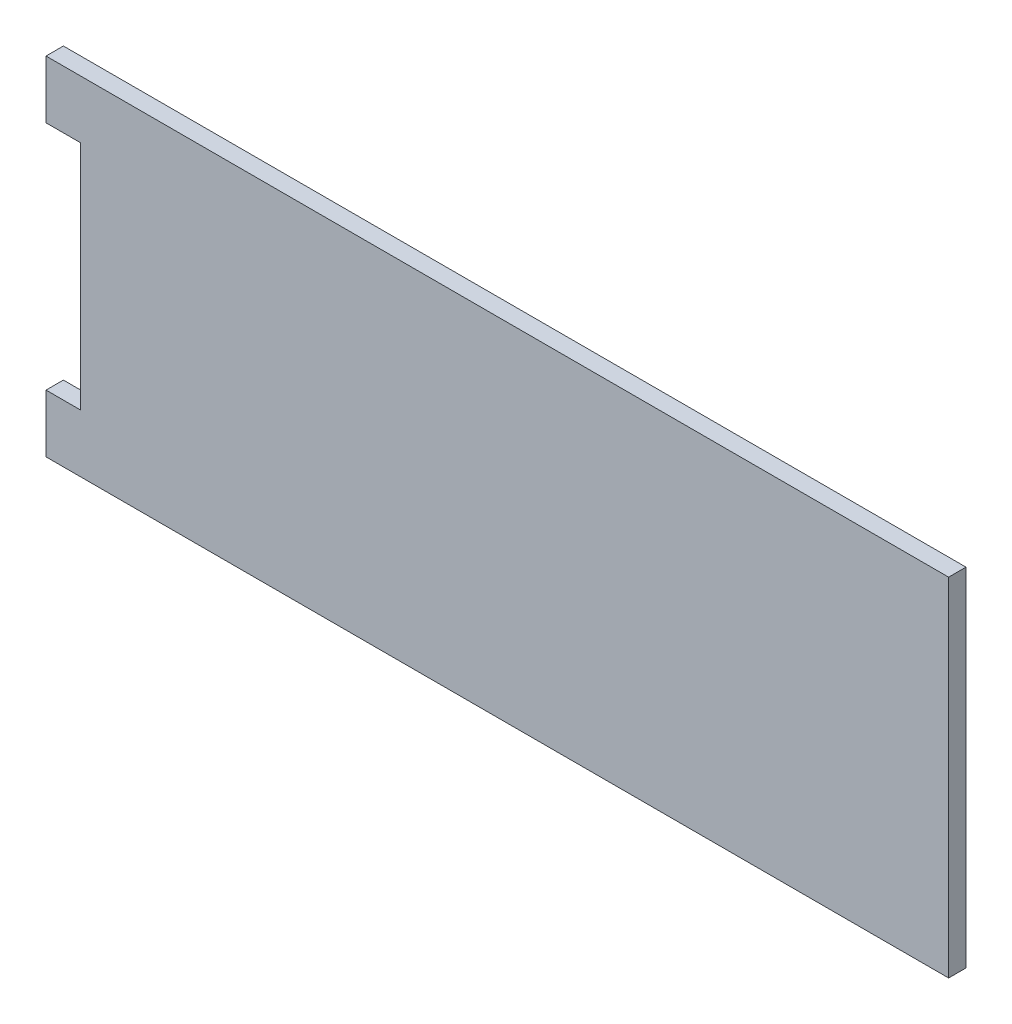
ISO-10303-21;
HEADER;
FILE_DESCRIPTION(('STEP AP214'),'2;1');
FILE_NAME('part.step','',(''),(''),'','','');
FILE_SCHEMA(('AUTOMOTIVE_DESIGN { 1 0 10303 214 1 1 1 1 }'));
ENDSEC;
DATA;
#1=APPLICATION_CONTEXT('core data for automotive mechanical design processes');
#2=APPLICATION_PROTOCOL_DEFINITION('international standard','automotive_design',2000,#1);
#3=PRODUCT_CONTEXT('',#1,'mechanical');
#4=PRODUCT('Part','Part','',(#3));
#5=PRODUCT_RELATED_PRODUCT_CATEGORY('part','',(#4));
#6=PRODUCT_DEFINITION_FORMATION('','',#4);
#7=PRODUCT_DEFINITION_CONTEXT('part definition',#1,'design');
#8=PRODUCT_DEFINITION('design','',#6,#7);
#9=PRODUCT_DEFINITION_SHAPE('','',#8);
#10=(LENGTH_UNIT() NAMED_UNIT(*) SI_UNIT(.MILLI.,.METRE.));
#11=(NAMED_UNIT(*) PLANE_ANGLE_UNIT() SI_UNIT($,.RADIAN.));
#12=(NAMED_UNIT(*) SI_UNIT($,.STERADIAN.) SOLID_ANGLE_UNIT());
#13=UNCERTAINTY_MEASURE_WITH_UNIT(LENGTH_MEASURE(1.E-05),#10,'distance_accuracy_value','');
#14=(GEOMETRIC_REPRESENTATION_CONTEXT(3) GLOBAL_UNCERTAINTY_ASSIGNED_CONTEXT((#13)) GLOBAL_UNIT_ASSIGNED_CONTEXT((#10,
#11,#12)) REPRESENTATION_CONTEXT('',''));
#15=CARTESIAN_POINT('',(0.,0.,0.));
#16=DIRECTION('',(0.,0.,1.));
#17=DIRECTION('',(1.,0.,0.));
#18=AXIS2_PLACEMENT_3D('',#15,#16,#17);
#19=CARTESIAN_POINT('',(38.4121859152886,105.992647464859,3.));
#20=DIRECTION('',(-1.,0.,0.));
#21=DIRECTION('',(0.,-1.,0.));
#22=AXIS2_PLACEMENT_3D('',#19,#20,#21);
#23=PLANE('',#22);
#24=DIRECTION('',(0.,1.,0.));
#25=VECTOR('',#24,1.);
#26=CARTESIAN_POINT('',(38.4121859152886,105.992647464859,0.));
#27=LINE('',#26,#25);
#28=CARTESIAN_POINT('',(38.4121859152886,45.9926474648593,0.));
#29=VERTEX_POINT('',#28);
#30=CARTESIAN_POINT('',(38.4121859152886,105.992647464859,0.));
#31=VERTEX_POINT('',#30);
#32=EDGE_CURVE('E130',#29,#31,#27,.T.);
#33=ORIENTED_EDGE('',*,*,#32,.T.);
#34=DIRECTION('',(0.,0.,-1.));
#35=VECTOR('',#34,1.);
#36=CARTESIAN_POINT('',(38.4121859152886,105.992647464859,3.));
#37=LINE('',#36,#35);
#38=CARTESIAN_POINT('',(38.4121859152886,105.992647464859,3.));
#39=VERTEX_POINT('',#38);
#40=EDGE_CURVE('E11',#39,#31,#37,.T.);
#41=ORIENTED_EDGE('',*,*,#40,.F.);
#42=DIRECTION('',(0.,1.,0.));
#43=VECTOR('',#42,1.);
#44=CARTESIAN_POINT('',(38.4121859152886,105.992647464859,3.));
#45=LINE('',#44,#43);
#46=CARTESIAN_POINT('',(38.4121859152886,45.9926474648593,3.));
#47=VERTEX_POINT('',#46);
#48=EDGE_CURVE('E145',#47,#39,#45,.T.);
#49=ORIENTED_EDGE('',*,*,#48,.F.);
#50=DIRECTION('',(0.,0.,-1.));
#51=VECTOR('',#50,1.);
#52=CARTESIAN_POINT('',(38.4121859152886,45.9926474648593,3.));
#53=LINE('',#52,#51);
#54=EDGE_CURVE('E126',#47,#29,#53,.T.);
#55=ORIENTED_EDGE('',*,*,#54,.T.);
#56=EDGE_LOOP('',(#33,#41,#49,#55));
#57=FACE_BOUND('',#56,.T.);
#58=ADVANCED_FACE('F33',(#57),#23,.F.);
#59=CARTESIAN_POINT('',(-111.587814084711,105.992647464859,3.));
#60=DIRECTION('',(0.,-1.,0.));
#61=DIRECTION('',(0.,0.,-1.));
#62=AXIS2_PLACEMENT_3D('',#59,#60,#61);
#63=PLANE('',#62);
#64=DIRECTION('',(-1.,0.,0.));
#65=VECTOR('',#64,1.);
#66=CARTESIAN_POINT('',(-111.587814084711,105.992647464859,0.));
#67=LINE('',#66,#65);
#68=CARTESIAN_POINT('',(-117.587814084711,105.992647464859,0.));
#69=VERTEX_POINT('',#68);
#70=EDGE_CURVE('E133',#31,#69,#67,.T.);
#71=ORIENTED_EDGE('',*,*,#70,.T.);
#72=DIRECTION('',(0.,0.,-1.));
#73=VECTOR('',#72,1.);
#74=CARTESIAN_POINT('',(-117.587814084711,105.992647464859,3.));
#75=LINE('',#74,#73);
#76=CARTESIAN_POINT('',(-117.587814084711,105.992647464859,3.));
#77=VERTEX_POINT('',#76);
#78=EDGE_CURVE('E41',#77,#69,#75,.T.);
#79=ORIENTED_EDGE('',*,*,#78,.F.);
#80=DIRECTION('',(-1.,0.,0.));
#81=VECTOR('',#80,1.);
#82=CARTESIAN_POINT('',(-111.587814084711,105.992647464859,3.));
#83=LINE('',#82,#81);
#84=EDGE_CURVE('E90',#39,#77,#83,.T.);
#85=ORIENTED_EDGE('',*,*,#84,.F.);
#86=ORIENTED_EDGE('',*,*,#40,.T.);
#87=EDGE_LOOP('',(#71,#79,#85,#86));
#88=FACE_BOUND('',#87,.T.);
#89=ADVANCED_FACE('F178',(#88),#63,.F.);
#90=CARTESIAN_POINT('',(-117.587814084711,105.992647464859,3.));
#91=DIRECTION('',(1.,0.,0.));
#92=DIRECTION('',(0.,0.,-1.));
#93=AXIS2_PLACEMENT_3D('',#90,#91,#92);
#94=PLANE('',#93);
#95=DIRECTION('',(0.,-1.,0.));
#96=VECTOR('',#95,1.);
#97=CARTESIAN_POINT('',(-117.587814084711,105.992647464859,0.));
#98=LINE('',#97,#96);
#99=CARTESIAN_POINT('',(-117.587814084711,95.9926474648593,0.));
#100=VERTEX_POINT('',#99);
#101=EDGE_CURVE('E135',#69,#100,#98,.T.);
#102=ORIENTED_EDGE('',*,*,#101,.T.);
#103=DIRECTION('',(0.,0.,-1.));
#104=VECTOR('',#103,1.);
#105=CARTESIAN_POINT('',(-117.587814084711,95.9926474648593,3.));
#106=LINE('',#105,#104);
#107=CARTESIAN_POINT('',(-117.587814084711,95.9926474648593,3.));
#108=VERTEX_POINT('',#107);
#109=EDGE_CURVE('E152',#108,#100,#106,.T.);
#110=ORIENTED_EDGE('',*,*,#109,.F.);
#111=DIRECTION('',(0.,-1.,0.));
#112=VECTOR('',#111,1.);
#113=CARTESIAN_POINT('',(-117.587814084711,105.992647464859,3.));
#114=LINE('',#113,#112);
#115=EDGE_CURVE('E160',#77,#108,#114,.T.);
#116=ORIENTED_EDGE('',*,*,#115,.F.);
#117=ORIENTED_EDGE('',*,*,#78,.T.);
#118=EDGE_LOOP('',(#102,#110,#116,#117));
#119=FACE_BOUND('',#118,.T.);
#120=ADVANCED_FACE('F158',(#119),#94,.F.);
#121=CARTESIAN_POINT('',(-111.587814084711,95.9926474648593,3.));
#122=DIRECTION('',(0.,1.,0.));
#123=DIRECTION('',(0.,0.,1.));
#124=AXIS2_PLACEMENT_3D('',#121,#122,#123);
#125=PLANE('',#124);
#126=DIRECTION('',(1.,0.,0.));
#127=VECTOR('',#126,1.);
#128=CARTESIAN_POINT('',(-111.587814084711,95.9926474648593,0.));
#129=LINE('',#128,#127);
#130=CARTESIAN_POINT('',(-111.587814084711,95.9926474648593,0.));
#131=VERTEX_POINT('',#130);
#132=EDGE_CURVE('E137',#100,#131,#129,.T.);
#133=ORIENTED_EDGE('',*,*,#132,.T.);
#134=DIRECTION('',(0.,0.,-1.));
#135=VECTOR('',#134,1.);
#136=CARTESIAN_POINT('',(-111.587814084711,95.9926474648593,3.));
#137=LINE('',#136,#135);
#138=CARTESIAN_POINT('',(-111.587814084711,95.9926474648593,3.));
#139=VERTEX_POINT('',#138);
#140=EDGE_CURVE('E149',#139,#131,#137,.T.);
#141=ORIENTED_EDGE('',*,*,#140,.F.);
#142=DIRECTION('',(1.,0.,0.));
#143=VECTOR('',#142,1.);
#144=CARTESIAN_POINT('',(-111.587814084711,95.9926474648593,3.));
#145=LINE('',#144,#143);
#146=EDGE_CURVE('E170',#108,#139,#145,.T.);
#147=ORIENTED_EDGE('',*,*,#146,.F.);
#148=ORIENTED_EDGE('',*,*,#109,.T.);
#149=EDGE_LOOP('',(#133,#141,#147,#148));
#150=FACE_BOUND('',#149,.T.);
#151=ADVANCED_FACE('F166',(#150),#125,.F.);
#152=CARTESIAN_POINT('',(-111.587814084711,95.9926474648593,3.));
#153=DIRECTION('',(1.,0.,0.));
#154=DIRECTION('',(0.,0.,-1.));
#155=AXIS2_PLACEMENT_3D('',#152,#153,#154);
#156=PLANE('',#155);
#157=DIRECTION('',(0.,-1.,0.));
#158=VECTOR('',#157,1.);
#159=CARTESIAN_POINT('',(-111.587814084711,95.9926474648593,0.));
#160=LINE('',#159,#158);
#161=CARTESIAN_POINT('',(-111.587814084711,55.9926474648593,0.));
#162=VERTEX_POINT('',#161);
#163=EDGE_CURVE('E139',#131,#162,#160,.T.);
#164=ORIENTED_EDGE('',*,*,#163,.T.);
#165=DIRECTION('',(0.,0.,-1.));
#166=VECTOR('',#165,1.);
#167=CARTESIAN_POINT('',(-111.587814084711,55.9926474648593,3.));
#168=LINE('',#167,#166);
#169=CARTESIAN_POINT('',(-111.587814084711,55.9926474648593,3.));
#170=VERTEX_POINT('',#169);
#171=EDGE_CURVE('E121',#170,#162,#168,.T.);
#172=ORIENTED_EDGE('',*,*,#171,.F.);
#173=DIRECTION('',(0.,-1.,0.));
#174=VECTOR('',#173,1.);
#175=CARTESIAN_POINT('',(-111.587814084711,95.9926474648593,3.));
#176=LINE('',#175,#174);
#177=EDGE_CURVE('E110',#139,#170,#176,.T.);
#178=ORIENTED_EDGE('',*,*,#177,.F.);
#179=ORIENTED_EDGE('',*,*,#140,.T.);
#180=EDGE_LOOP('',(#164,#172,#178,#179));
#181=FACE_BOUND('',#180,.T.);
#182=ADVANCED_FACE('F169',(#181),#156,.F.);
#183=CARTESIAN_POINT('',(-111.587814084711,55.9926474648593,3.));
#184=DIRECTION('',(0.,-1.,0.));
#185=DIRECTION('',(1.,0.,0.));
#186=AXIS2_PLACEMENT_3D('',#183,#184,#185);
#187=PLANE('',#186);
#188=DIRECTION('',(-1.,0.,0.));
#189=VECTOR('',#188,1.);
#190=CARTESIAN_POINT('',(-111.587814084711,55.9926474648593,0.));
#191=LINE('',#190,#189);
#192=CARTESIAN_POINT('',(-117.587814084711,55.9926474648593,0.));
#193=VERTEX_POINT('',#192);
#194=EDGE_CURVE('E119',#162,#193,#191,.T.);
#195=ORIENTED_EDGE('',*,*,#194,.T.);
#196=DIRECTION('',(0.,0.,-1.));
#197=VECTOR('',#196,1.);
#198=CARTESIAN_POINT('',(-117.587814084711,55.9926474648593,3.));
#199=LINE('',#198,#197);
#200=CARTESIAN_POINT('',(-117.587814084711,55.9926474648593,3.));
#201=VERTEX_POINT('',#200);
#202=EDGE_CURVE('E116',#201,#193,#199,.T.);
#203=ORIENTED_EDGE('',*,*,#202,.F.);
#204=DIRECTION('',(-1.,0.,0.));
#205=VECTOR('',#204,1.);
#206=CARTESIAN_POINT('',(-111.587814084711,55.9926474648593,3.));
#207=LINE('',#206,#205);
#208=EDGE_CURVE('E103',#170,#201,#207,.T.);
#209=ORIENTED_EDGE('',*,*,#208,.F.);
#210=ORIENTED_EDGE('',*,*,#171,.T.);
#211=EDGE_LOOP('',(#195,#203,#209,#210));
#212=FACE_BOUND('',#211,.T.);
#213=ADVANCED_FACE('F117',(#212),#187,.F.);
#214=CARTESIAN_POINT('',(-117.587814084711,55.9926474648593,3.));
#215=DIRECTION('',(1.,0.,0.));
#216=DIRECTION('',(0.,0.,-1.));
#217=AXIS2_PLACEMENT_3D('',#214,#215,#216);
#218=PLANE('',#217);
#219=DIRECTION('',(0.,-1.,0.));
#220=VECTOR('',#219,1.);
#221=CARTESIAN_POINT('',(-117.587814084711,55.9926474648593,0.));
#222=LINE('',#221,#220);
#223=CARTESIAN_POINT('',(-117.587814084711,45.9926474648593,0.));
#224=VERTEX_POINT('',#223);
#225=EDGE_CURVE('E142',#193,#224,#222,.T.);
#226=ORIENTED_EDGE('',*,*,#225,.T.);
#227=DIRECTION('',(0.,0.,-1.));
#228=VECTOR('',#227,1.);
#229=CARTESIAN_POINT('',(-117.587814084711,45.9926474648593,3.));
#230=LINE('',#229,#228);
#231=CARTESIAN_POINT('',(-117.587814084711,45.9926474648593,3.));
#232=VERTEX_POINT('',#231);
#233=EDGE_CURVE('E122',#232,#224,#230,.T.);
#234=ORIENTED_EDGE('',*,*,#233,.F.);
#235=DIRECTION('',(0.,-1.,0.));
#236=VECTOR('',#235,1.);
#237=CARTESIAN_POINT('',(-117.587814084711,55.9926474648593,3.));
#238=LINE('',#237,#236);
#239=EDGE_CURVE('E107',#201,#232,#238,.T.);
#240=ORIENTED_EDGE('',*,*,#239,.F.);
#241=ORIENTED_EDGE('',*,*,#202,.T.);
#242=EDGE_LOOP('',(#226,#234,#240,#241));
#243=FACE_BOUND('',#242,.T.);
#244=ADVANCED_FACE('F124',(#243),#218,.F.);
#245=CARTESIAN_POINT('',(-111.587814084711,45.9926474648593,3.));
#246=DIRECTION('',(0.,1.,0.));
#247=DIRECTION('',(0.,0.,1.));
#248=AXIS2_PLACEMENT_3D('',#245,#246,#247);
#249=PLANE('',#248);
#250=DIRECTION('',(1.,0.,0.));
#251=VECTOR('',#250,1.);
#252=CARTESIAN_POINT('',(-111.587814084711,45.9926474648593,0.));
#253=LINE('',#252,#251);
#254=EDGE_CURVE('E78',#224,#29,#253,.T.);
#255=ORIENTED_EDGE('',*,*,#254,.T.);
#256=ORIENTED_EDGE('',*,*,#54,.F.);
#257=DIRECTION('',(1.,0.,0.));
#258=VECTOR('',#257,1.);
#259=CARTESIAN_POINT('',(-111.587814084711,45.9926474648593,3.));
#260=LINE('',#259,#258);
#261=EDGE_CURVE('E49',#232,#47,#260,.T.);
#262=ORIENTED_EDGE('',*,*,#261,.F.);
#263=ORIENTED_EDGE('',*,*,#233,.T.);
#264=EDGE_LOOP('',(#255,#256,#262,#263));
#265=FACE_BOUND('',#264,.T.);
#266=ADVANCED_FACE('F194',(#265),#249,.F.);
#267=CARTESIAN_POINT('',(0.,0.,3.));
#268=DIRECTION('',(0.,0.,1.));
#269=DIRECTION('',(1.,0.,0.));
#270=AXIS2_PLACEMENT_3D('',#267,#268,#269);
#271=PLANE('',#270);
#272=ORIENTED_EDGE('',*,*,#48,.T.);
#273=ORIENTED_EDGE('',*,*,#84,.T.);
#274=ORIENTED_EDGE('',*,*,#115,.T.);
#275=ORIENTED_EDGE('',*,*,#146,.T.);
#276=ORIENTED_EDGE('',*,*,#177,.T.);
#277=ORIENTED_EDGE('',*,*,#208,.T.);
#278=ORIENTED_EDGE('',*,*,#239,.T.);
#279=ORIENTED_EDGE('',*,*,#261,.T.);
#280=EDGE_LOOP('',(#272,#273,#274,#275,#276,#277,#278,#279));
#281=FACE_BOUND('',#280,.T.);
#282=ADVANCED_FACE('F105',(#281),#271,.T.);
#283=CARTESIAN_POINT('',(0.,0.,0.));
#284=DIRECTION('',(0.,0.,1.));
#285=DIRECTION('',(1.,0.,0.));
#286=AXIS2_PLACEMENT_3D('',#283,#284,#285);
#287=PLANE('',#286);
#288=ORIENTED_EDGE('',*,*,#32,.F.);
#289=ORIENTED_EDGE('',*,*,#254,.F.);
#290=ORIENTED_EDGE('',*,*,#225,.F.);
#291=ORIENTED_EDGE('',*,*,#194,.F.);
#292=ORIENTED_EDGE('',*,*,#163,.F.);
#293=ORIENTED_EDGE('',*,*,#132,.F.);
#294=ORIENTED_EDGE('',*,*,#101,.F.);
#295=ORIENTED_EDGE('',*,*,#70,.F.);
#296=EDGE_LOOP('',(#288,#289,#290,#291,#292,#293,#294,#295));
#297=FACE_BOUND('',#296,.T.);
#298=ADVANCED_FACE('F162',(#297),#287,.F.);
#299=CLOSED_SHELL('',(#58,#89,#120,#151,#182,#213,#244,#266,#282,#298));
#300=MANIFOLD_SOLID_BREP('B2',#299);
#301=ADVANCED_BREP_SHAPE_REPRESENTATION('',(#18,#300),#14);
#302=SHAPE_DEFINITION_REPRESENTATION(#9,#301);
ENDSEC;
END-ISO-10303-21;
